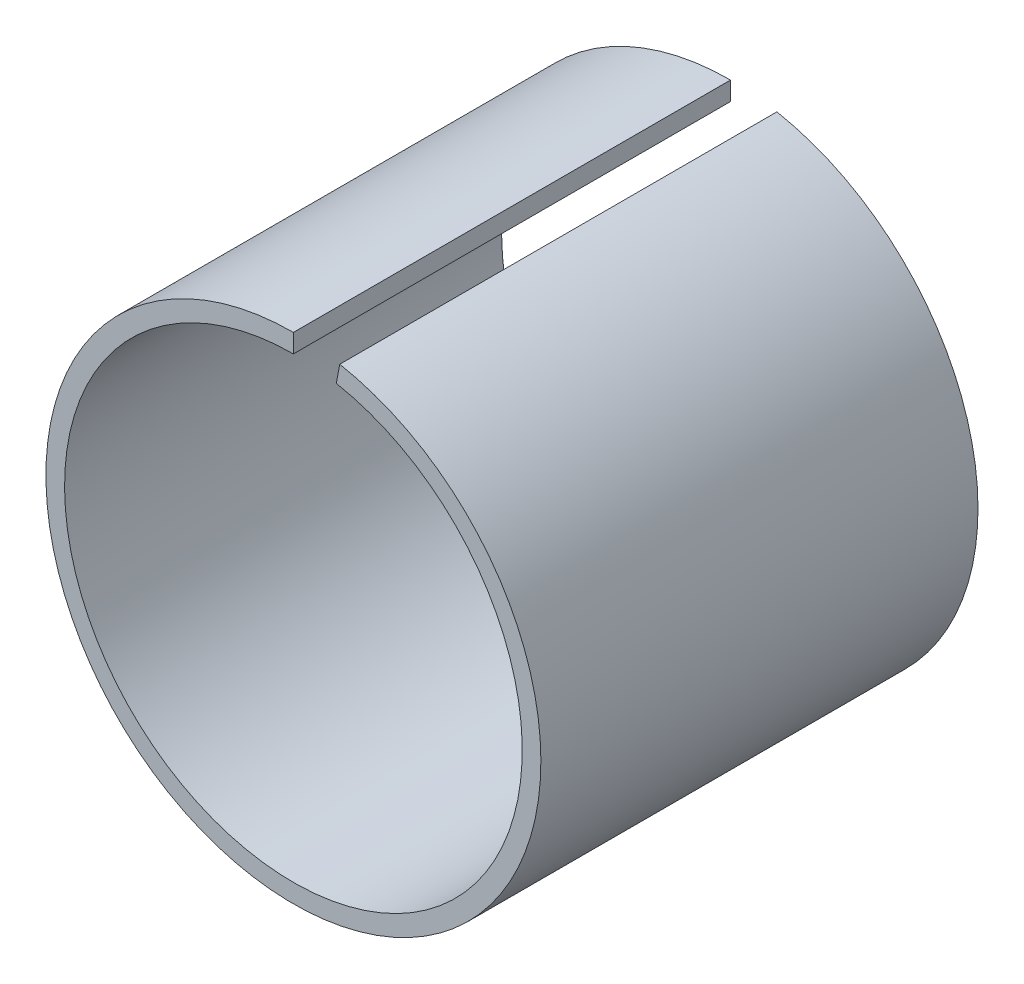
ISO-10303-21;
HEADER;
FILE_DESCRIPTION(('STEP AP214'),'2;1');
FILE_NAME('part.step','',(''),(''),'','','');
FILE_SCHEMA(('AUTOMOTIVE_DESIGN { 1 0 10303 214 1 1 1 1 }'));
ENDSEC;
DATA;
#1=APPLICATION_CONTEXT('core data for automotive mechanical design processes');
#2=APPLICATION_PROTOCOL_DEFINITION('international standard','automotive_design',2000,#1);
#3=PRODUCT_CONTEXT('',#1,'mechanical');
#4=PRODUCT('Part','Part','',(#3));
#5=PRODUCT_RELATED_PRODUCT_CATEGORY('part','',(#4));
#6=PRODUCT_DEFINITION_FORMATION('','',#4);
#7=PRODUCT_DEFINITION_CONTEXT('part definition',#1,'design');
#8=PRODUCT_DEFINITION('design','',#6,#7);
#9=PRODUCT_DEFINITION_SHAPE('','',#8);
#10=(LENGTH_UNIT() NAMED_UNIT(*) SI_UNIT(.MILLI.,.METRE.));
#11=(NAMED_UNIT(*) PLANE_ANGLE_UNIT() SI_UNIT($,.RADIAN.));
#12=(NAMED_UNIT(*) SI_UNIT($,.STERADIAN.) SOLID_ANGLE_UNIT());
#13=UNCERTAINTY_MEASURE_WITH_UNIT(LENGTH_MEASURE(1.E-05),#10,'distance_accuracy_value','');
#14=(GEOMETRIC_REPRESENTATION_CONTEXT(3) GLOBAL_UNCERTAINTY_ASSIGNED_CONTEXT((#13)) GLOBAL_UNIT_ASSIGNED_CONTEXT((#10,
#11,#12)) REPRESENTATION_CONTEXT('',''));
#15=CARTESIAN_POINT('',(0.,0.,0.));
#16=DIRECTION('',(0.,0.,1.));
#17=DIRECTION('',(1.,0.,0.));
#18=AXIS2_PLACEMENT_3D('',#15,#16,#17);
#19=CARTESIAN_POINT('',(0.,0.,-42.));
#20=DIRECTION('',(0.,0.,1.));
#21=DIRECTION('',(1.,0.,0.));
#22=AXIS2_PLACEMENT_3D('',#19,#20,#21);
#23=PLANE('',#22);
#24=DIRECTION('',(0.187367126858958,0.982289957076127,0.));
#25=VECTOR('',#24,1.);
#26=CARTESIAN_POINT('',(1.66756742904474,8.74238061797753,-42.));
#27=LINE('',#26,#25);
#28=CARTESIAN_POINT('',(3.33513485808947,17.4847612359551,-42.));
#29=VERTEX_POINT('',#28);
#30=CARTESIAN_POINT('',(3.60681719203495,18.9090816737154,-42.));
#31=VERTEX_POINT('',#30);
#32=EDGE_CURVE('E11',#29,#31,#27,.T.);
#33=ORIENTED_EDGE('',*,*,#32,.T.);
#34=CARTESIAN_POINT('',(0.,0.,-42.));
#35=DIRECTION('',(0.,0.,-1.));
#36=DIRECTION('',(0.,1.,0.));
#37=AXIS2_PLACEMENT_3D('',#34,#35,#36);
#38=CIRCLE('',#37,19.25);
#39=CARTESIAN_POINT('',(0.,19.25,-42.));
#40=VERTEX_POINT('',#39);
#41=EDGE_CURVE('E114',#31,#40,#38,.T.);
#42=ORIENTED_EDGE('',*,*,#41,.T.);
#43=DIRECTION('',(0.,-1.,0.));
#44=VECTOR('',#43,1.);
#45=CARTESIAN_POINT('',(0.,9.625,-42.));
#46=LINE('',#45,#44);
#47=CARTESIAN_POINT('',(0.,17.8,-42.));
#48=VERTEX_POINT('',#47);
#49=EDGE_CURVE('E83',#40,#48,#46,.T.);
#50=ORIENTED_EDGE('',*,*,#49,.T.);
#51=CARTESIAN_POINT('',(0.,0.,-42.));
#52=DIRECTION('',(0.,0.,1.));
#53=DIRECTION('',(1.,0.,0.));
#54=AXIS2_PLACEMENT_3D('',#51,#52,#53);
#55=CIRCLE('',#54,17.8);
#56=EDGE_CURVE('E90',#48,#29,#55,.T.);
#57=ORIENTED_EDGE('',*,*,#56,.T.);
#58=EDGE_LOOP('',(#33,#42,#50,#57));
#59=FACE_BOUND('',#58,.T.);
#60=ADVANCED_FACE('F18',(#59),#23,.F.);
#61=CARTESIAN_POINT('',(0.,0.,-8.));
#62=DIRECTION('',(0.,0.,1.));
#63=DIRECTION('',(1.,0.,0.));
#64=AXIS2_PLACEMENT_3D('',#61,#62,#63);
#65=PLANE('',#64);
#66=DIRECTION('',(0.187367126858958,0.982289957076127,0.));
#67=VECTOR('',#66,1.);
#68=CARTESIAN_POINT('',(1.66756742904474,8.74238061797753,-8.));
#69=LINE('',#68,#67);
#70=CARTESIAN_POINT('',(3.33513485808947,17.4847612359551,-8.));
#71=VERTEX_POINT('',#70);
#72=CARTESIAN_POINT('',(3.60681719203495,18.9090816737154,-8.));
#73=VERTEX_POINT('',#72);
#74=EDGE_CURVE('E26',#71,#73,#69,.T.);
#75=ORIENTED_EDGE('',*,*,#74,.F.);
#76=CARTESIAN_POINT('',(0.,0.,-8.));
#77=DIRECTION('',(0.,0.,1.));
#78=DIRECTION('',(1.,0.,0.));
#79=AXIS2_PLACEMENT_3D('',#76,#77,#78);
#80=CIRCLE('',#79,17.8);
#81=CARTESIAN_POINT('',(0.,17.8,-8.));
#82=VERTEX_POINT('',#81);
#83=EDGE_CURVE('E89',#82,#71,#80,.T.);
#84=ORIENTED_EDGE('',*,*,#83,.F.);
#85=DIRECTION('',(0.,-1.,0.));
#86=VECTOR('',#85,1.);
#87=CARTESIAN_POINT('',(0.,9.625,-8.));
#88=LINE('',#87,#86);
#89=CARTESIAN_POINT('',(0.,19.25,-8.));
#90=VERTEX_POINT('',#89);
#91=EDGE_CURVE('E71',#90,#82,#88,.T.);
#92=ORIENTED_EDGE('',*,*,#91,.F.);
#93=CARTESIAN_POINT('',(0.,0.,-8.));
#94=DIRECTION('',(0.,0.,-1.));
#95=DIRECTION('',(0.,1.,0.));
#96=AXIS2_PLACEMENT_3D('',#93,#94,#95);
#97=CIRCLE('',#96,19.25);
#98=EDGE_CURVE('E111',#73,#90,#97,.T.);
#99=ORIENTED_EDGE('',*,*,#98,.F.);
#100=EDGE_LOOP('',(#75,#84,#92,#99));
#101=FACE_BOUND('',#100,.T.);
#102=ADVANCED_FACE('F93',(#101),#65,.T.);
#103=CARTESIAN_POINT('',(3.33513485808947,17.4847612359551,-8.));
#104=DIRECTION('',(-0.982289957076127,0.187367126858958,0.));
#105=DIRECTION('',(0.,0.,1.));
#106=AXIS2_PLACEMENT_3D('',#103,#104,#105);
#107=PLANE('',#106);
#108=ORIENTED_EDGE('',*,*,#74,.T.);
#109=DIRECTION('',(0.,0.,-1.));
#110=VECTOR('',#109,1.);
#111=CARTESIAN_POINT('',(3.60681719203495,18.9090816737154,-8.));
#112=LINE('',#111,#110);
#113=EDGE_CURVE('E105',#73,#31,#112,.T.);
#114=ORIENTED_EDGE('',*,*,#113,.T.);
#115=ORIENTED_EDGE('',*,*,#32,.F.);
#116=DIRECTION('',(0.,0.,-1.));
#117=VECTOR('',#116,1.);
#118=CARTESIAN_POINT('',(3.33513485808947,17.4847612359551,-8.));
#119=LINE('',#118,#117);
#120=EDGE_CURVE('E95',#71,#29,#119,.T.);
#121=ORIENTED_EDGE('',*,*,#120,.F.);
#122=EDGE_LOOP('',(#108,#114,#115,#121));
#123=FACE_BOUND('',#122,.T.);
#124=ADVANCED_FACE('F121',(#123),#107,.T.);
#125=CARTESIAN_POINT('',(0.,0.,-8.));
#126=DIRECTION('',(0.,0.,-1.));
#127=DIRECTION('',(-0.0941011235955052,-0.99556264420581,0.));
#128=AXIS2_PLACEMENT_3D('',#125,#126,#127);
#129=CYLINDRICAL_SURFACE('',#128,19.25);
#130=ORIENTED_EDGE('',*,*,#98,.T.);
#131=DIRECTION('',(0.,0.,-1.));
#132=VECTOR('',#131,1.);
#133=CARTESIAN_POINT('',(0.,19.25,-8.));
#134=LINE('',#133,#132);
#135=EDGE_CURVE('E78',#90,#40,#134,.T.);
#136=ORIENTED_EDGE('',*,*,#135,.T.);
#137=ORIENTED_EDGE('',*,*,#41,.F.);
#138=ORIENTED_EDGE('',*,*,#113,.F.);
#139=EDGE_LOOP('',(#130,#136,#137,#138));
#140=FACE_BOUND('',#139,.T.);
#141=ADVANCED_FACE('F123',(#140),#129,.T.);
#142=CARTESIAN_POINT('',(0.,19.25,-8.));
#143=DIRECTION('',(1.,0.,0.));
#144=DIRECTION('',(0.,1.,0.));
#145=AXIS2_PLACEMENT_3D('',#142,#143,#144);
#146=PLANE('',#145);
#147=ORIENTED_EDGE('',*,*,#91,.T.);
#148=DIRECTION('',(0.,0.,-1.));
#149=VECTOR('',#148,1.);
#150=CARTESIAN_POINT('',(0.,17.8,-8.));
#151=LINE('',#150,#149);
#152=EDGE_CURVE('E75',#82,#48,#151,.T.);
#153=ORIENTED_EDGE('',*,*,#152,.T.);
#154=ORIENTED_EDGE('',*,*,#49,.F.);
#155=ORIENTED_EDGE('',*,*,#135,.F.);
#156=EDGE_LOOP('',(#147,#153,#154,#155));
#157=FACE_BOUND('',#156,.T.);
#158=ADVANCED_FACE('F73',(#157),#146,.T.);
#159=CARTESIAN_POINT('',(0.,0.,-8.));
#160=DIRECTION('',(0.,0.,-1.));
#161=DIRECTION('',(-0.0941011235955057,-0.99556264420581,0.));
#162=AXIS2_PLACEMENT_3D('',#159,#160,#161);
#163=CYLINDRICAL_SURFACE('',#162,17.8);
#164=ORIENTED_EDGE('',*,*,#83,.T.);
#165=ORIENTED_EDGE('',*,*,#120,.T.);
#166=ORIENTED_EDGE('',*,*,#56,.F.);
#167=ORIENTED_EDGE('',*,*,#152,.F.);
#168=EDGE_LOOP('',(#164,#165,#166,#167));
#169=FACE_BOUND('',#168,.T.);
#170=ADVANCED_FACE('F87',(#169),#163,.F.);
#171=CLOSED_SHELL('',(#60,#102,#124,#141,#158,#170));
#172=MANIFOLD_SOLID_BREP('B1',#171);
#173=ADVANCED_BREP_SHAPE_REPRESENTATION('',(#18,#172),#14);
#174=SHAPE_DEFINITION_REPRESENTATION(#9,#173);
ENDSEC;
END-ISO-10303-21;
